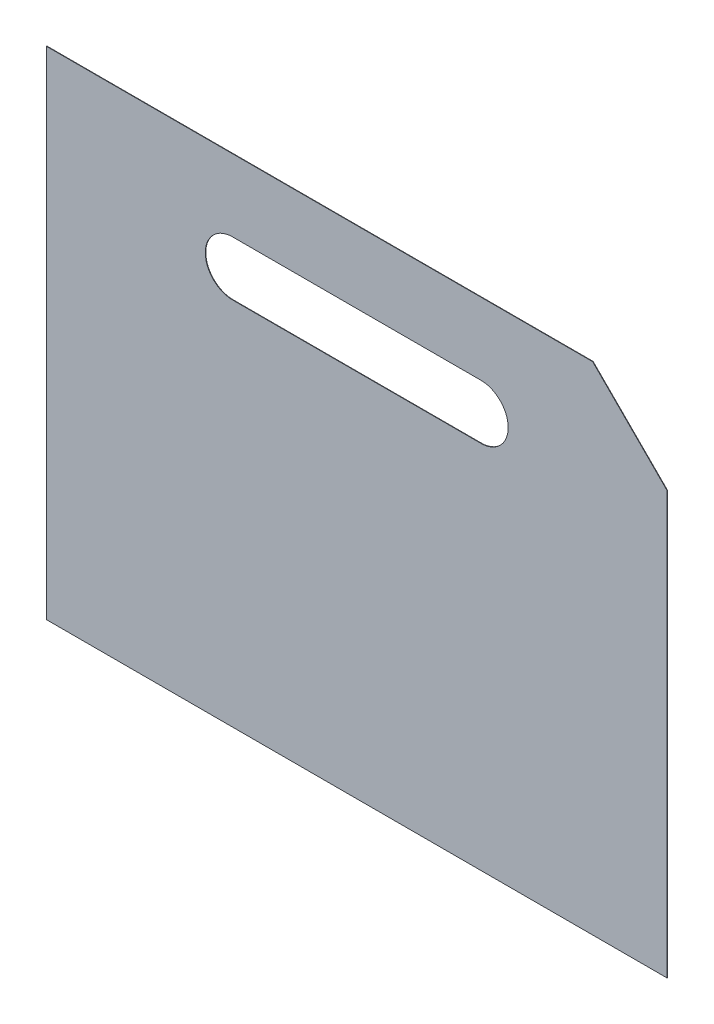
ISO-10303-21;
HEADER;
FILE_DESCRIPTION(('STEP AP214'),'2;1');
FILE_NAME('part.step','',(''),(''),'','','');
FILE_SCHEMA(('AUTOMOTIVE_DESIGN { 1 0 10303 214 1 1 1 1 }'));
ENDSEC;
DATA;
#1=APPLICATION_CONTEXT('core data for automotive mechanical design processes');
#2=APPLICATION_PROTOCOL_DEFINITION('international standard','automotive_design',2000,#1);
#3=PRODUCT_CONTEXT('',#1,'mechanical');
#4=PRODUCT('Part','Part','',(#3));
#5=PRODUCT_RELATED_PRODUCT_CATEGORY('part','',(#4));
#6=PRODUCT_DEFINITION_FORMATION('','',#4);
#7=PRODUCT_DEFINITION_CONTEXT('part definition',#1,'design');
#8=PRODUCT_DEFINITION('design','',#6,#7);
#9=PRODUCT_DEFINITION_SHAPE('','',#8);
#10=(LENGTH_UNIT() NAMED_UNIT(*) SI_UNIT(.MILLI.,.METRE.));
#11=(NAMED_UNIT(*) PLANE_ANGLE_UNIT() SI_UNIT($,.RADIAN.));
#12=(NAMED_UNIT(*) SI_UNIT($,.STERADIAN.) SOLID_ANGLE_UNIT());
#13=UNCERTAINTY_MEASURE_WITH_UNIT(LENGTH_MEASURE(1.E-05),#10,'distance_accuracy_value','');
#14=(GEOMETRIC_REPRESENTATION_CONTEXT(3) GLOBAL_UNCERTAINTY_ASSIGNED_CONTEXT((#13)) GLOBAL_UNIT_ASSIGNED_CONTEXT((#10,
#11,#12)) REPRESENTATION_CONTEXT('',''));
#15=CARTESIAN_POINT('',(0.,0.,0.));
#16=DIRECTION('',(0.,0.,1.));
#17=DIRECTION('',(1.,0.,0.));
#18=AXIS2_PLACEMENT_3D('',#15,#16,#17);
#19=CARTESIAN_POINT('',(0.,0.,0.19));
#20=DIRECTION('',(1.,0.,0.));
#21=DIRECTION('',(0.,0.,-1.));
#22=AXIS2_PLACEMENT_3D('',#19,#20,#21);
#23=PLANE('',#22);
#24=DIRECTION('',(0.,-1.,0.));
#25=VECTOR('',#24,1.);
#26=CARTESIAN_POINT('',(0.,0.,0.));
#27=LINE('',#26,#25);
#28=CARTESIAN_POINT('',(0.,200.,0.));
#29=VERTEX_POINT('',#28);
#30=CARTESIAN_POINT('',(0.,0.,0.));
#31=VERTEX_POINT('',#30);
#32=EDGE_CURVE('E136',#29,#31,#27,.T.);
#33=ORIENTED_EDGE('',*,*,#32,.T.);
#34=DIRECTION('',(0.,0.,-1.));
#35=VECTOR('',#34,1.);
#36=CARTESIAN_POINT('',(0.,0.,0.19));
#37=LINE('',#36,#35);
#38=CARTESIAN_POINT('',(0.,0.,0.19));
#39=VERTEX_POINT('',#38);
#40=EDGE_CURVE('E11',#39,#31,#37,.T.);
#41=ORIENTED_EDGE('',*,*,#40,.F.);
#42=DIRECTION('',(0.,-1.,0.));
#43=VECTOR('',#42,1.);
#44=CARTESIAN_POINT('',(0.,0.,0.19));
#45=LINE('',#44,#43);
#46=CARTESIAN_POINT('',(0.,200.,0.19));
#47=VERTEX_POINT('',#46);
#48=EDGE_CURVE('E149',#47,#39,#45,.T.);
#49=ORIENTED_EDGE('',*,*,#48,.F.);
#50=DIRECTION('',(0.,0.,-1.));
#51=VECTOR('',#50,1.);
#52=CARTESIAN_POINT('',(0.,200.,0.19));
#53=LINE('',#52,#51);
#54=EDGE_CURVE('E160',#47,#29,#53,.T.);
#55=ORIENTED_EDGE('',*,*,#54,.T.);
#56=EDGE_LOOP('',(#33,#41,#49,#55));
#57=FACE_BOUND('',#56,.T.);
#58=ADVANCED_FACE('F32',(#57),#23,.F.);
#59=CARTESIAN_POINT('',(0.,0.,0.19));
#60=DIRECTION('',(0.,1.,0.));
#61=DIRECTION('',(0.,0.,1.));
#62=AXIS2_PLACEMENT_3D('',#59,#60,#61);
#63=PLANE('',#62);
#64=DIRECTION('',(1.,0.,0.));
#65=VECTOR('',#64,1.);
#66=CARTESIAN_POINT('',(0.,0.,0.));
#67=LINE('',#66,#65);
#68=CARTESIAN_POINT('',(250.,0.,0.));
#69=VERTEX_POINT('',#68);
#70=EDGE_CURVE('E163',#31,#69,#67,.T.);
#71=ORIENTED_EDGE('',*,*,#70,.T.);
#72=DIRECTION('',(0.,0.,-1.));
#73=VECTOR('',#72,1.);
#74=CARTESIAN_POINT('',(250.,0.,0.19));
#75=LINE('',#74,#73);
#76=CARTESIAN_POINT('',(250.,0.,0.19));
#77=VERTEX_POINT('',#76);
#78=EDGE_CURVE('E39',#77,#69,#75,.T.);
#79=ORIENTED_EDGE('',*,*,#78,.F.);
#80=DIRECTION('',(1.,0.,0.));
#81=VECTOR('',#80,1.);
#82=CARTESIAN_POINT('',(0.,0.,0.19));
#83=LINE('',#82,#81);
#84=EDGE_CURVE('E152',#39,#77,#83,.T.);
#85=ORIENTED_EDGE('',*,*,#84,.F.);
#86=ORIENTED_EDGE('',*,*,#40,.T.);
#87=EDGE_LOOP('',(#71,#79,#85,#86));
#88=FACE_BOUND('',#87,.T.);
#89=ADVANCED_FACE('F191',(#88),#63,.F.);
#90=CARTESIAN_POINT('',(250.,0.,0.19));
#91=DIRECTION('',(-1.,0.,0.));
#92=DIRECTION('',(0.,0.,1.));
#93=AXIS2_PLACEMENT_3D('',#90,#91,#92);
#94=PLANE('',#93);
#95=DIRECTION('',(0.,1.,0.));
#96=VECTOR('',#95,1.);
#97=CARTESIAN_POINT('',(250.,0.,0.));
#98=LINE('',#97,#96);
#99=CARTESIAN_POINT('',(250.,170.,0.));
#100=VERTEX_POINT('',#99);
#101=EDGE_CURVE('E165',#69,#100,#98,.T.);
#102=ORIENTED_EDGE('',*,*,#101,.T.);
#103=DIRECTION('',(0.,0.,1.));
#104=VECTOR('',#103,1.);
#105=CARTESIAN_POINT('',(250.,170.,0.));
#106=LINE('',#105,#104);
#107=CARTESIAN_POINT('',(250.,170.,0.19));
#108=VERTEX_POINT('',#107);
#109=EDGE_CURVE('E130',#100,#108,#106,.T.);
#110=ORIENTED_EDGE('',*,*,#109,.T.);
#111=DIRECTION('',(0.,1.,0.));
#112=VECTOR('',#111,1.);
#113=CARTESIAN_POINT('',(250.,0.,0.19));
#114=LINE('',#113,#112);
#115=EDGE_CURVE('E155',#77,#108,#114,.T.);
#116=ORIENTED_EDGE('',*,*,#115,.F.);
#117=ORIENTED_EDGE('',*,*,#78,.T.);
#118=EDGE_LOOP('',(#102,#110,#116,#117));
#119=FACE_BOUND('',#118,.T.);
#120=ADVANCED_FACE('F175',(#119),#94,.F.);
#121=CARTESIAN_POINT('',(0.,200.,0.19));
#122=DIRECTION('',(0.,-1.,0.));
#123=DIRECTION('',(0.,0.,-1.));
#124=AXIS2_PLACEMENT_3D('',#121,#122,#123);
#125=PLANE('',#124);
#126=DIRECTION('',(-1.,0.,0.));
#127=VECTOR('',#126,1.);
#128=CARTESIAN_POINT('',(0.,200.,0.19));
#129=LINE('',#128,#127);
#130=CARTESIAN_POINT('',(220.,200.,0.19));
#131=VERTEX_POINT('',#130);
#132=EDGE_CURVE('E158',#131,#47,#129,.T.);
#133=ORIENTED_EDGE('',*,*,#132,.F.);
#134=DIRECTION('',(0.,0.,1.));
#135=VECTOR('',#134,1.);
#136=CARTESIAN_POINT('',(220.,200.,0.));
#137=LINE('',#136,#135);
#138=CARTESIAN_POINT('',(220.,200.,0.));
#139=VERTEX_POINT('',#138);
#140=EDGE_CURVE('E143',#139,#131,#137,.T.);
#141=ORIENTED_EDGE('',*,*,#140,.F.);
#142=DIRECTION('',(-1.,0.,0.));
#143=VECTOR('',#142,1.);
#144=CARTESIAN_POINT('',(0.,200.,0.));
#145=LINE('',#144,#143);
#146=EDGE_CURVE('E153',#139,#29,#145,.T.);
#147=ORIENTED_EDGE('',*,*,#146,.T.);
#148=ORIENTED_EDGE('',*,*,#54,.F.);
#149=EDGE_LOOP('',(#133,#141,#147,#148));
#150=FACE_BOUND('',#149,.T.);
#151=ADVANCED_FACE('F185',(#150),#125,.F.);
#152=CARTESIAN_POINT('',(0.,0.,0.19));
#153=DIRECTION('',(0.,0.,-1.));
#154=DIRECTION('',(-1.,0.,0.));
#155=AXIS2_PLACEMENT_3D('',#152,#153,#154);
#156=PLANE('',#155);
#157=DIRECTION('',(1.,0.,0.));
#158=VECTOR('',#157,1.);
#159=CARTESIAN_POINT('',(75.,149.,0.19));
#160=LINE('',#159,#158);
#161=CARTESIAN_POINT('',(75.,149.,0.19));
#162=VERTEX_POINT('',#161);
#163=CARTESIAN_POINT('',(175.,149.,0.19));
#164=VERTEX_POINT('',#163);
#165=EDGE_CURVE('E129',#162,#164,#160,.T.);
#166=ORIENTED_EDGE('',*,*,#165,.F.);
#167=CARTESIAN_POINT('',(75.,160.,0.19));
#168=DIRECTION('',(0.,0.,1.));
#169=DIRECTION('',(1.,0.,0.));
#170=AXIS2_PLACEMENT_3D('',#167,#168,#169);
#171=CIRCLE('',#170,11.);
#172=CARTESIAN_POINT('',(75.,171.,0.19));
#173=VERTEX_POINT('',#172);
#174=EDGE_CURVE('E46',#173,#162,#171,.T.);
#175=ORIENTED_EDGE('',*,*,#174,.F.);
#176=DIRECTION('',(-1.,0.,0.));
#177=VECTOR('',#176,1.);
#178=CARTESIAN_POINT('',(75.,171.,0.19));
#179=LINE('',#178,#177);
#180=CARTESIAN_POINT('',(175.,171.,0.19));
#181=VERTEX_POINT('',#180);
#182=EDGE_CURVE('E120',#181,#173,#179,.T.);
#183=ORIENTED_EDGE('',*,*,#182,.F.);
#184=CARTESIAN_POINT('',(175.,160.,0.19));
#185=DIRECTION('',(0.,0.,1.));
#186=DIRECTION('',(1.,0.,0.));
#187=AXIS2_PLACEMENT_3D('',#184,#185,#186);
#188=CIRCLE('',#187,11.);
#189=EDGE_CURVE('E123',#164,#181,#188,.T.);
#190=ORIENTED_EDGE('',*,*,#189,.F.);
#191=EDGE_LOOP('',(#166,#175,#183,#190));
#192=FACE_BOUND('',#191,.T.);
#193=ORIENTED_EDGE('',*,*,#115,.T.);
#194=DIRECTION('',(0.707106781186547,-0.707106781186548,0.));
#195=VECTOR('',#194,1.);
#196=CARTESIAN_POINT('',(220.,200.,0.19));
#197=LINE('',#196,#195);
#198=EDGE_CURVE('E144',#131,#108,#197,.T.);
#199=ORIENTED_EDGE('',*,*,#198,.F.);
#200=ORIENTED_EDGE('',*,*,#132,.T.);
#201=ORIENTED_EDGE('',*,*,#48,.T.);
#202=ORIENTED_EDGE('',*,*,#84,.T.);
#203=EDGE_LOOP('',(#193,#199,#200,#201,#202));
#204=FACE_BOUND('',#203,.T.);
#205=ADVANCED_FACE('F189',(#192,#204),#156,.F.);
#206=CARTESIAN_POINT('',(0.,0.,0.));
#207=DIRECTION('',(0.,0.,-1.));
#208=DIRECTION('',(-1.,0.,0.));
#209=AXIS2_PLACEMENT_3D('',#206,#207,#208);
#210=PLANE('',#209);
#211=CARTESIAN_POINT('',(75.,160.,0.));
#212=DIRECTION('',(0.,0.,1.));
#213=DIRECTION('',(1.,0.,0.));
#214=AXIS2_PLACEMENT_3D('',#211,#212,#213);
#215=CIRCLE('',#214,11.);
#216=CARTESIAN_POINT('',(75.,171.,0.));
#217=VERTEX_POINT('',#216);
#218=CARTESIAN_POINT('',(75.,149.,0.));
#219=VERTEX_POINT('',#218);
#220=EDGE_CURVE('E104',#217,#219,#215,.T.);
#221=ORIENTED_EDGE('',*,*,#220,.T.);
#222=DIRECTION('',(1.,0.,0.));
#223=VECTOR('',#222,1.);
#224=CARTESIAN_POINT('',(75.,149.,0.));
#225=LINE('',#224,#223);
#226=CARTESIAN_POINT('',(175.,149.,0.));
#227=VERTEX_POINT('',#226);
#228=EDGE_CURVE('E113',#219,#227,#225,.T.);
#229=ORIENTED_EDGE('',*,*,#228,.T.);
#230=CARTESIAN_POINT('',(175.,160.,0.));
#231=DIRECTION('',(0.,0.,1.));
#232=DIRECTION('',(1.,0.,0.));
#233=AXIS2_PLACEMENT_3D('',#230,#231,#232);
#234=CIRCLE('',#233,11.);
#235=CARTESIAN_POINT('',(175.,171.,0.));
#236=VERTEX_POINT('',#235);
#237=EDGE_CURVE('E54',#227,#236,#234,.T.);
#238=ORIENTED_EDGE('',*,*,#237,.T.);
#239=DIRECTION('',(-1.,0.,0.));
#240=VECTOR('',#239,1.);
#241=CARTESIAN_POINT('',(75.,171.,0.));
#242=LINE('',#241,#240);
#243=EDGE_CURVE('E110',#236,#217,#242,.T.);
#244=ORIENTED_EDGE('',*,*,#243,.T.);
#245=EDGE_LOOP('',(#221,#229,#238,#244));
#246=FACE_BOUND('',#245,.T.);
#247=DIRECTION('',(0.707106781186547,-0.707106781186548,0.));
#248=VECTOR('',#247,1.);
#249=CARTESIAN_POINT('',(220.,200.,0.));
#250=LINE('',#249,#248);
#251=EDGE_CURVE('E140',#139,#100,#250,.T.);
#252=ORIENTED_EDGE('',*,*,#251,.T.);
#253=ORIENTED_EDGE('',*,*,#101,.F.);
#254=ORIENTED_EDGE('',*,*,#70,.F.);
#255=ORIENTED_EDGE('',*,*,#32,.F.);
#256=ORIENTED_EDGE('',*,*,#146,.F.);
#257=EDGE_LOOP('',(#252,#253,#254,#255,#256));
#258=FACE_BOUND('',#257,.T.);
#259=ADVANCED_FACE('F117',(#246,#258),#210,.T.);
#260=CARTESIAN_POINT('',(220.,200.,0.));
#261=DIRECTION('',(-0.707106781186548,-0.707106781186547,0.));
#262=DIRECTION('',(0.707106781186547,-0.707106781186548,0.));
#263=AXIS2_PLACEMENT_3D('',#260,#261,#262);
#264=PLANE('',#263);
#265=ORIENTED_EDGE('',*,*,#198,.T.);
#266=ORIENTED_EDGE('',*,*,#109,.F.);
#267=ORIENTED_EDGE('',*,*,#251,.F.);
#268=ORIENTED_EDGE('',*,*,#140,.T.);
#269=EDGE_LOOP('',(#265,#266,#267,#268));
#270=FACE_BOUND('',#269,.T.);
#271=ADVANCED_FACE('F181',(#270),#264,.F.);
#272=CARTESIAN_POINT('',(75.,160.,0.));
#273=DIRECTION('',(0.,0.,1.));
#274=DIRECTION('',(1.,0.,0.));
#275=AXIS2_PLACEMENT_3D('',#272,#273,#274);
#276=CYLINDRICAL_SURFACE('',#275,11.);
#277=ORIENTED_EDGE('',*,*,#174,.T.);
#278=DIRECTION('',(0.,0.,1.));
#279=VECTOR('',#278,1.);
#280=CARTESIAN_POINT('',(75.,149.,0.));
#281=LINE('',#280,#279);
#282=EDGE_CURVE('E100',#219,#162,#281,.T.);
#283=ORIENTED_EDGE('',*,*,#282,.F.);
#284=ORIENTED_EDGE('',*,*,#220,.F.);
#285=DIRECTION('',(0.,0.,1.));
#286=VECTOR('',#285,1.);
#287=CARTESIAN_POINT('',(75.,171.,0.));
#288=LINE('',#287,#286);
#289=EDGE_CURVE('E134',#217,#173,#288,.T.);
#290=ORIENTED_EDGE('',*,*,#289,.T.);
#291=EDGE_LOOP('',(#277,#283,#284,#290));
#292=FACE_BOUND('',#291,.T.);
#293=ADVANCED_FACE('F102',(#292),#276,.F.);
#294=CARTESIAN_POINT('',(75.,171.,0.));
#295=DIRECTION('',(0.,1.,0.));
#296=DIRECTION('',(0.,0.,1.));
#297=AXIS2_PLACEMENT_3D('',#294,#295,#296);
#298=PLANE('',#297);
#299=ORIENTED_EDGE('',*,*,#182,.T.);
#300=ORIENTED_EDGE('',*,*,#289,.F.);
#301=ORIENTED_EDGE('',*,*,#243,.F.);
#302=DIRECTION('',(0.,0.,1.));
#303=VECTOR('',#302,1.);
#304=CARTESIAN_POINT('',(175.,171.,0.));
#305=LINE('',#304,#303);
#306=EDGE_CURVE('E137',#236,#181,#305,.T.);
#307=ORIENTED_EDGE('',*,*,#306,.T.);
#308=EDGE_LOOP('',(#299,#300,#301,#307));
#309=FACE_BOUND('',#308,.T.);
#310=ADVANCED_FACE('F213',(#309),#298,.F.);
#311=CARTESIAN_POINT('',(175.,160.,0.));
#312=DIRECTION('',(0.,0.,1.));
#313=DIRECTION('',(1.,0.,0.));
#314=AXIS2_PLACEMENT_3D('',#311,#312,#313);
#315=CYLINDRICAL_SURFACE('',#314,11.);
#316=ORIENTED_EDGE('',*,*,#189,.T.);
#317=ORIENTED_EDGE('',*,*,#306,.F.);
#318=ORIENTED_EDGE('',*,*,#237,.F.);
#319=DIRECTION('',(0.,0.,1.));
#320=VECTOR('',#319,1.);
#321=CARTESIAN_POINT('',(175.,149.,0.));
#322=LINE('',#321,#320);
#323=EDGE_CURVE('E109',#227,#164,#322,.T.);
#324=ORIENTED_EDGE('',*,*,#323,.T.);
#325=EDGE_LOOP('',(#316,#317,#318,#324));
#326=FACE_BOUND('',#325,.T.);
#327=ADVANCED_FACE('F216',(#326),#315,.F.);
#328=CARTESIAN_POINT('',(75.,149.,0.));
#329=DIRECTION('',(0.,-1.,0.));
#330=DIRECTION('',(0.,0.,-1.));
#331=AXIS2_PLACEMENT_3D('',#328,#329,#330);
#332=PLANE('',#331);
#333=ORIENTED_EDGE('',*,*,#165,.T.);
#334=ORIENTED_EDGE('',*,*,#323,.F.);
#335=ORIENTED_EDGE('',*,*,#228,.F.);
#336=ORIENTED_EDGE('',*,*,#282,.T.);
#337=EDGE_LOOP('',(#333,#334,#335,#336));
#338=FACE_BOUND('',#337,.T.);
#339=ADVANCED_FACE('F114',(#338),#332,.F.);
#340=CLOSED_SHELL('',(#58,#89,#120,#151,#205,#259,#271,#293,#310,#327,#339));
#341=MANIFOLD_SOLID_BREP('B2',#340);
#342=ADVANCED_BREP_SHAPE_REPRESENTATION('',(#18,#341),#14);
#343=SHAPE_DEFINITION_REPRESENTATION(#9,#342);
ENDSEC;
END-ISO-10303-21;
